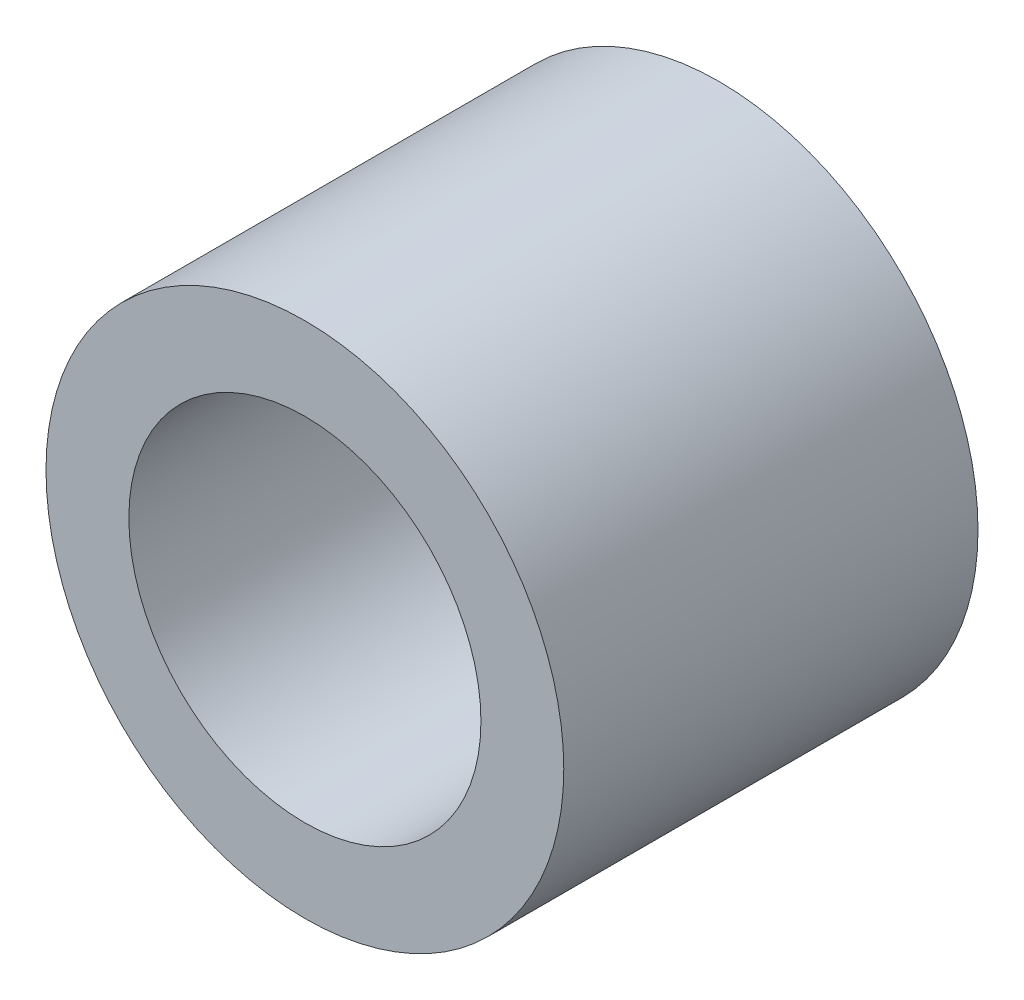
ISO-10303-21;
HEADER;
FILE_DESCRIPTION(('STEP AP214'),'2;1');
FILE_NAME('part.step','',(''),(''),'','','');
FILE_SCHEMA(('AUTOMOTIVE_DESIGN { 1 0 10303 214 1 1 1 1 }'));
ENDSEC;
DATA;
#1=APPLICATION_CONTEXT('core data for automotive mechanical design processes');
#2=APPLICATION_PROTOCOL_DEFINITION('international standard','automotive_design',2000,#1);
#3=PRODUCT_CONTEXT('',#1,'mechanical');
#4=PRODUCT('Part','Part','',(#3));
#5=PRODUCT_RELATED_PRODUCT_CATEGORY('part','',(#4));
#6=PRODUCT_DEFINITION_FORMATION('','',#4);
#7=PRODUCT_DEFINITION_CONTEXT('part definition',#1,'design');
#8=PRODUCT_DEFINITION('design','',#6,#7);
#9=PRODUCT_DEFINITION_SHAPE('','',#8);
#10=(LENGTH_UNIT() NAMED_UNIT(*) SI_UNIT(.MILLI.,.METRE.));
#11=(NAMED_UNIT(*) PLANE_ANGLE_UNIT() SI_UNIT($,.RADIAN.));
#12=(NAMED_UNIT(*) SI_UNIT($,.STERADIAN.) SOLID_ANGLE_UNIT());
#13=UNCERTAINTY_MEASURE_WITH_UNIT(LENGTH_MEASURE(1.E-05),#10,'distance_accuracy_value','');
#14=(GEOMETRIC_REPRESENTATION_CONTEXT(3) GLOBAL_UNCERTAINTY_ASSIGNED_CONTEXT((#13)) GLOBAL_UNIT_ASSIGNED_CONTEXT((#10,
#11,#12)) REPRESENTATION_CONTEXT('',''));
#15=CARTESIAN_POINT('',(0.,0.,0.));
#16=DIRECTION('',(0.,0.,1.));
#17=DIRECTION('',(1.,0.,0.));
#18=AXIS2_PLACEMENT_3D('',#15,#16,#17);
#19=CARTESIAN_POINT('',(-44.1445616062401,4.57882420915788,10.));
#20=DIRECTION('',(0.,0.,1.));
#21=DIRECTION('',(1.,0.,0.));
#22=AXIS2_PLACEMENT_3D('',#19,#20,#21);
#23=PLANE('',#22);
#24=CARTESIAN_POINT('',(-44.1445616062401,4.57882420915788,10.));
#25=DIRECTION('',(0.,0.,1.));
#26=DIRECTION('',(1.,0.,0.));
#27=AXIS2_PLACEMENT_3D('',#24,#25,#26);
#28=CIRCLE('',#27,6.25);
#29=CARTESIAN_POINT('',(-37.8945616062401,4.57882420915788,10.));
#30=VERTEX_POINT('',#29);
#31=EDGE_CURVE('E10',#30,#30,#28,.T.);
#32=ORIENTED_EDGE('',*,*,#31,.T.);
#33=EDGE_LOOP('',(#32));
#34=FACE_BOUND('',#33,.T.);
#35=CARTESIAN_POINT('',(-44.1445616062401,4.57882420915788,10.));
#36=DIRECTION('',(0.,0.,1.));
#37=DIRECTION('',(1.,0.,0.));
#38=AXIS2_PLACEMENT_3D('',#35,#36,#37);
#39=CIRCLE('',#38,4.25000000000001);
#40=CARTESIAN_POINT('',(-39.8945616062401,4.57882420915788,10.));
#41=VERTEX_POINT('',#40);
#42=EDGE_CURVE('E50',#41,#41,#39,.T.);
#43=ORIENTED_EDGE('',*,*,#42,.F.);
#44=EDGE_LOOP('',(#43));
#45=FACE_BOUND('',#44,.T.);
#46=ADVANCED_FACE('F37',(#34,#45),#23,.T.);
#47=CARTESIAN_POINT('',(-44.1445616062401,4.57882420915788,0.));
#48=DIRECTION('',(0.,0.,1.));
#49=DIRECTION('',(1.,0.,0.));
#50=AXIS2_PLACEMENT_3D('',#47,#48,#49);
#51=PLANE('',#50);
#52=CARTESIAN_POINT('',(-44.1445616062401,4.57882420915788,0.));
#53=DIRECTION('',(0.,0.,1.));
#54=DIRECTION('',(1.,0.,0.));
#55=AXIS2_PLACEMENT_3D('',#52,#53,#54);
#56=CIRCLE('',#55,6.25);
#57=CARTESIAN_POINT('',(-37.8945616062401,4.57882420915788,0.));
#58=VERTEX_POINT('',#57);
#59=EDGE_CURVE('E41',#58,#58,#56,.T.);
#60=ORIENTED_EDGE('',*,*,#59,.F.);
#61=EDGE_LOOP('',(#60));
#62=FACE_BOUND('',#61,.T.);
#63=CARTESIAN_POINT('',(-44.1445616062401,4.57882420915788,0.));
#64=DIRECTION('',(0.,0.,1.));
#65=DIRECTION('',(1.,0.,0.));
#66=AXIS2_PLACEMENT_3D('',#63,#64,#65);
#67=CIRCLE('',#66,4.25000000000001);
#68=CARTESIAN_POINT('',(-39.8945616062401,4.57882420915788,0.));
#69=VERTEX_POINT('',#68);
#70=EDGE_CURVE('E52',#69,#69,#67,.T.);
#71=ORIENTED_EDGE('',*,*,#70,.T.);
#72=EDGE_LOOP('',(#71));
#73=FACE_BOUND('',#72,.T.);
#74=ADVANCED_FACE('F64',(#62,#73),#51,.F.);
#75=CARTESIAN_POINT('',(-44.1445616062401,4.57882420915788,10.));
#76=DIRECTION('',(0.,0.,-1.));
#77=DIRECTION('',(-1.,0.,0.));
#78=AXIS2_PLACEMENT_3D('',#75,#76,#77);
#79=CYLINDRICAL_SURFACE('',#78,6.25);
#80=ORIENTED_EDGE('',*,*,#31,.F.);
#81=EDGE_LOOP('',(#80));
#82=FACE_BOUND('',#81,.T.);
#83=ORIENTED_EDGE('',*,*,#59,.T.);
#84=EDGE_LOOP('',(#83));
#85=FACE_BOUND('',#84,.T.);
#86=ADVANCED_FACE('F39',(#82,#85),#79,.T.);
#87=CARTESIAN_POINT('',(-44.1445616062401,4.57882420915788,10.));
#88=DIRECTION('',(0.,0.,-1.));
#89=DIRECTION('',(-1.,0.,0.));
#90=AXIS2_PLACEMENT_3D('',#87,#88,#89);
#91=CYLINDRICAL_SURFACE('',#90,4.25000000000001);
#92=ORIENTED_EDGE('',*,*,#42,.T.);
#93=EDGE_LOOP('',(#92));
#94=FACE_BOUND('',#93,.T.);
#95=ORIENTED_EDGE('',*,*,#70,.F.);
#96=EDGE_LOOP('',(#95));
#97=FACE_BOUND('',#96,.T.);
#98=ADVANCED_FACE('F60',(#94,#97),#91,.F.);
#99=CLOSED_SHELL('',(#46,#74,#86,#98));
#100=MANIFOLD_SOLID_BREP('B2',#99);
#101=ADVANCED_BREP_SHAPE_REPRESENTATION('',(#18,#100),#14);
#102=SHAPE_DEFINITION_REPRESENTATION(#9,#101);
ENDSEC;
END-ISO-10303-21;
